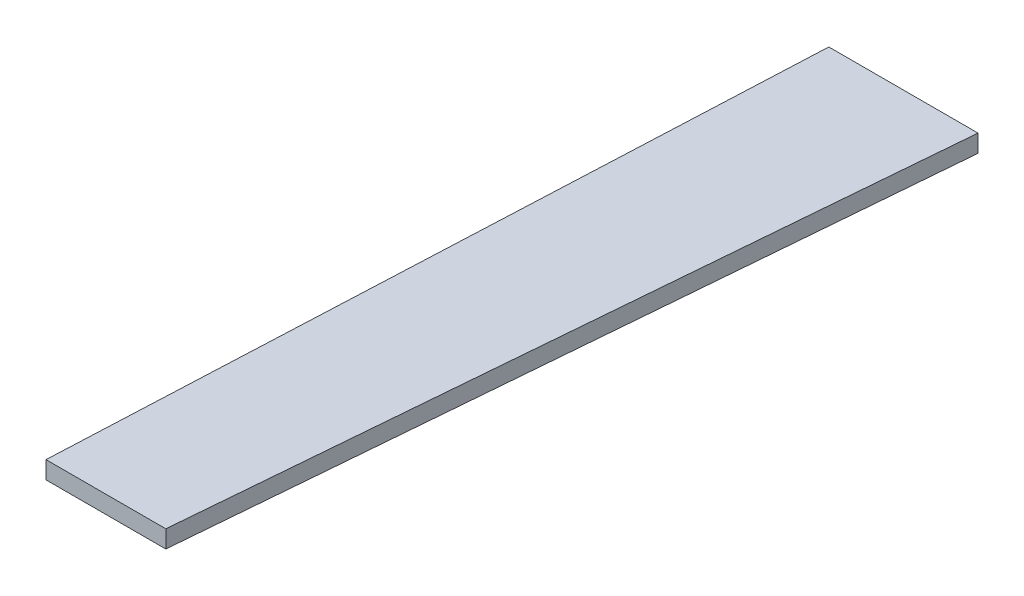
ISO-10303-21;
HEADER;
FILE_DESCRIPTION(('STEP AP214'),'2;1');
FILE_NAME('part.step','',(''),(''),'','','');
FILE_SCHEMA(('AUTOMOTIVE_DESIGN { 1 0 10303 214 1 1 1 1 }'));
ENDSEC;
DATA;
#1=APPLICATION_CONTEXT('core data for automotive mechanical design processes');
#2=APPLICATION_PROTOCOL_DEFINITION('international standard','automotive_design',2000,#1);
#3=PRODUCT_CONTEXT('',#1,'mechanical');
#4=PRODUCT('Part','Part','',(#3));
#5=PRODUCT_RELATED_PRODUCT_CATEGORY('part','',(#4));
#6=PRODUCT_DEFINITION_FORMATION('','',#4);
#7=PRODUCT_DEFINITION_CONTEXT('part definition',#1,'design');
#8=PRODUCT_DEFINITION('design','',#6,#7);
#9=PRODUCT_DEFINITION_SHAPE('','',#8);
#10=(LENGTH_UNIT() NAMED_UNIT(*) SI_UNIT(.MILLI.,.METRE.));
#11=(NAMED_UNIT(*) PLANE_ANGLE_UNIT() SI_UNIT($,.RADIAN.));
#12=(NAMED_UNIT(*) SI_UNIT($,.STERADIAN.) SOLID_ANGLE_UNIT());
#13=UNCERTAINTY_MEASURE_WITH_UNIT(LENGTH_MEASURE(1.E-05),#10,'distance_accuracy_value','');
#14=(GEOMETRIC_REPRESENTATION_CONTEXT(3) GLOBAL_UNCERTAINTY_ASSIGNED_CONTEXT((#13)) GLOBAL_UNIT_ASSIGNED_CONTEXT((#10,
#11,#12)) REPRESENTATION_CONTEXT('',''));
#15=CARTESIAN_POINT('',(0.,0.,0.));
#16=DIRECTION('',(0.,0.,1.));
#17=DIRECTION('',(1.,0.,0.));
#18=AXIS2_PLACEMENT_3D('',#15,#16,#17);
#19=CARTESIAN_POINT('',(0.,10.,0.));
#20=DIRECTION('',(0.998968642608713,0.,0.0454054080975572));
#21=DIRECTION('',(0.0454054080975572,0.,-0.998968642608713));
#22=AXIS2_PLACEMENT_3D('',#19,#20,#21);
#23=PLANE('',#22);
#24=DIRECTION('',(-0.0454054080975572,0.,0.998968642608713));
#25=VECTOR('',#24,1.);
#26=CARTESIAN_POINT('',(0.,0.,0.));
#27=LINE('',#26,#25);
#28=CARTESIAN_POINT('',(0.,0.,0.));
#29=VERTEX_POINT('',#28);
#30=CARTESIAN_POINT('',(-19.3953993318475,0.,426.72));
#31=VERTEX_POINT('',#30);
#32=EDGE_CURVE('E100',#29,#31,#27,.T.);
#33=ORIENTED_EDGE('',*,*,#32,.T.);
#34=DIRECTION('',(0.,-1.,0.));
#35=VECTOR('',#34,1.);
#36=CARTESIAN_POINT('',(-19.3953993318475,10.,426.72));
#37=LINE('',#36,#35);
#38=CARTESIAN_POINT('',(-19.3953993318475,10.,426.72));
#39=VERTEX_POINT('',#38);
#40=EDGE_CURVE('E11',#39,#31,#37,.T.);
#41=ORIENTED_EDGE('',*,*,#40,.F.);
#42=DIRECTION('',(-0.0454054080975572,0.,0.998968642608713));
#43=VECTOR('',#42,1.);
#44=CARTESIAN_POINT('',(0.,10.,0.));
#45=LINE('',#44,#43);
#46=CARTESIAN_POINT('',(0.,10.,0.));
#47=VERTEX_POINT('',#46);
#48=EDGE_CURVE('E88',#47,#39,#45,.T.);
#49=ORIENTED_EDGE('',*,*,#48,.F.);
#50=DIRECTION('',(0.,-1.,0.));
#51=VECTOR('',#50,1.);
#52=CARTESIAN_POINT('',(0.,10.,0.));
#53=LINE('',#52,#51);
#54=EDGE_CURVE('E96',#47,#29,#53,.T.);
#55=ORIENTED_EDGE('',*,*,#54,.T.);
#56=EDGE_LOOP('',(#33,#41,#49,#55));
#57=FACE_BOUND('',#56,.T.);
#58=ADVANCED_FACE('F37',(#57),#23,.F.);
#59=CARTESIAN_POINT('',(-19.3953993318475,10.,426.72));
#60=DIRECTION('',(0.,0.,-1.));
#61=DIRECTION('',(-1.,0.,0.));
#62=AXIS2_PLACEMENT_3D('',#59,#60,#61);
#63=PLANE('',#62);
#64=DIRECTION('',(1.,0.,0.));
#65=VECTOR('',#64,1.);
#66=CARTESIAN_POINT('',(-19.3953993318475,0.,426.72));
#67=LINE('',#66,#65);
#68=CARTESIAN_POINT('',(48.8714006681525,0.,426.72));
#69=VERTEX_POINT('',#68);
#70=EDGE_CURVE('E92',#31,#69,#67,.T.);
#71=ORIENTED_EDGE('',*,*,#70,.T.);
#72=DIRECTION('',(0.,-1.,0.));
#73=VECTOR('',#72,1.);
#74=CARTESIAN_POINT('',(48.8714006681525,10.,426.72));
#75=LINE('',#74,#73);
#76=CARTESIAN_POINT('',(48.8714006681525,10.,426.72));
#77=VERTEX_POINT('',#76);
#78=EDGE_CURVE('E45',#77,#69,#75,.T.);
#79=ORIENTED_EDGE('',*,*,#78,.F.);
#80=DIRECTION('',(1.,0.,0.));
#81=VECTOR('',#80,1.);
#82=CARTESIAN_POINT('',(-19.3953993318475,10.,426.72));
#83=LINE('',#82,#81);
#84=EDGE_CURVE('E83',#39,#77,#83,.T.);
#85=ORIENTED_EDGE('',*,*,#84,.F.);
#86=ORIENTED_EDGE('',*,*,#40,.T.);
#87=EDGE_LOOP('',(#71,#79,#85,#86));
#88=FACE_BOUND('',#87,.T.);
#89=ADVANCED_FACE('F91',(#88),#63,.F.);
#90=CARTESIAN_POINT('',(48.8714006681525,10.,426.72));
#91=DIRECTION('',(-0.996433077978671,0.,-0.0843867353910114));
#92=DIRECTION('',(-0.0843867353910114,0.,0.996433077978671));
#93=AXIS2_PLACEMENT_3D('',#90,#91,#92);
#94=PLANE('',#93);
#95=DIRECTION('',(0.0843867353910114,0.,-0.996433077978671));
#96=VECTOR('',#95,1.);
#97=CARTESIAN_POINT('',(48.8714006681525,0.,426.72));
#98=LINE('',#97,#96);
#99=CARTESIAN_POINT('',(85.0098112868566,0.,0.));
#100=VERTEX_POINT('',#99);
#101=EDGE_CURVE('E70',#69,#100,#98,.T.);
#102=ORIENTED_EDGE('',*,*,#101,.T.);
#103=DIRECTION('',(0.,-1.,0.));
#104=VECTOR('',#103,1.);
#105=CARTESIAN_POINT('',(85.0098112868566,10.,0.));
#106=LINE('',#105,#104);
#107=CARTESIAN_POINT('',(85.0098112868566,10.,0.));
#108=VERTEX_POINT('',#107);
#109=EDGE_CURVE('E93',#108,#100,#106,.T.);
#110=ORIENTED_EDGE('',*,*,#109,.F.);
#111=DIRECTION('',(0.0843867353910114,0.,-0.996433077978671));
#112=VECTOR('',#111,1.);
#113=CARTESIAN_POINT('',(48.8714006681525,10.,426.72));
#114=LINE('',#113,#112);
#115=EDGE_CURVE('E86',#77,#108,#114,.T.);
#116=ORIENTED_EDGE('',*,*,#115,.F.);
#117=ORIENTED_EDGE('',*,*,#78,.T.);
#118=EDGE_LOOP('',(#102,#110,#116,#117));
#119=FACE_BOUND('',#118,.T.);
#120=ADVANCED_FACE('F94',(#119),#94,.F.);
#121=CARTESIAN_POINT('',(85.0098112868566,10.,0.));
#122=DIRECTION('',(0.,0.,1.));
#123=DIRECTION('',(1.,0.,0.));
#124=AXIS2_PLACEMENT_3D('',#121,#122,#123);
#125=PLANE('',#124);
#126=DIRECTION('',(-1.,0.,0.));
#127=VECTOR('',#126,1.);
#128=CARTESIAN_POINT('',(85.0098112868566,0.,0.));
#129=LINE('',#128,#127);
#130=EDGE_CURVE('E76',#100,#29,#129,.T.);
#131=ORIENTED_EDGE('',*,*,#130,.T.);
#132=ORIENTED_EDGE('',*,*,#54,.F.);
#133=DIRECTION('',(-1.,0.,0.));
#134=VECTOR('',#133,1.);
#135=CARTESIAN_POINT('',(85.0098112868566,10.,0.));
#136=LINE('',#135,#134);
#137=EDGE_CURVE('E53',#108,#47,#136,.T.);
#138=ORIENTED_EDGE('',*,*,#137,.F.);
#139=ORIENTED_EDGE('',*,*,#109,.T.);
#140=EDGE_LOOP('',(#131,#132,#138,#139));
#141=FACE_BOUND('',#140,.T.);
#142=ADVANCED_FACE('F107',(#141),#125,.F.);
#143=CARTESIAN_POINT('',(0.,10.,0.));
#144=DIRECTION('',(0.,1.,0.));
#145=DIRECTION('',(0.,0.,1.));
#146=AXIS2_PLACEMENT_3D('',#143,#144,#145);
#147=PLANE('',#146);
#148=ORIENTED_EDGE('',*,*,#48,.T.);
#149=ORIENTED_EDGE('',*,*,#84,.T.);
#150=ORIENTED_EDGE('',*,*,#115,.T.);
#151=ORIENTED_EDGE('',*,*,#137,.T.);
#152=EDGE_LOOP('',(#148,#149,#150,#151));
#153=FACE_BOUND('',#152,.T.);
#154=ADVANCED_FACE('F84',(#153),#147,.T.);
#155=CARTESIAN_POINT('',(0.,0.,0.));
#156=DIRECTION('',(0.,1.,0.));
#157=DIRECTION('',(0.,0.,1.));
#158=AXIS2_PLACEMENT_3D('',#155,#156,#157);
#159=PLANE('',#158);
#160=ORIENTED_EDGE('',*,*,#32,.F.);
#161=ORIENTED_EDGE('',*,*,#130,.F.);
#162=ORIENTED_EDGE('',*,*,#101,.F.);
#163=ORIENTED_EDGE('',*,*,#70,.F.);
#164=EDGE_LOOP('',(#160,#161,#162,#163));
#165=FACE_BOUND('',#164,.T.);
#166=ADVANCED_FACE('F110',(#165),#159,.F.);
#167=CLOSED_SHELL('',(#58,#89,#120,#142,#154,#166));
#168=MANIFOLD_SOLID_BREP('B2',#167);
#169=ADVANCED_BREP_SHAPE_REPRESENTATION('',(#18,#168),#14);
#170=SHAPE_DEFINITION_REPRESENTATION(#9,#169);
ENDSEC;
END-ISO-10303-21;
